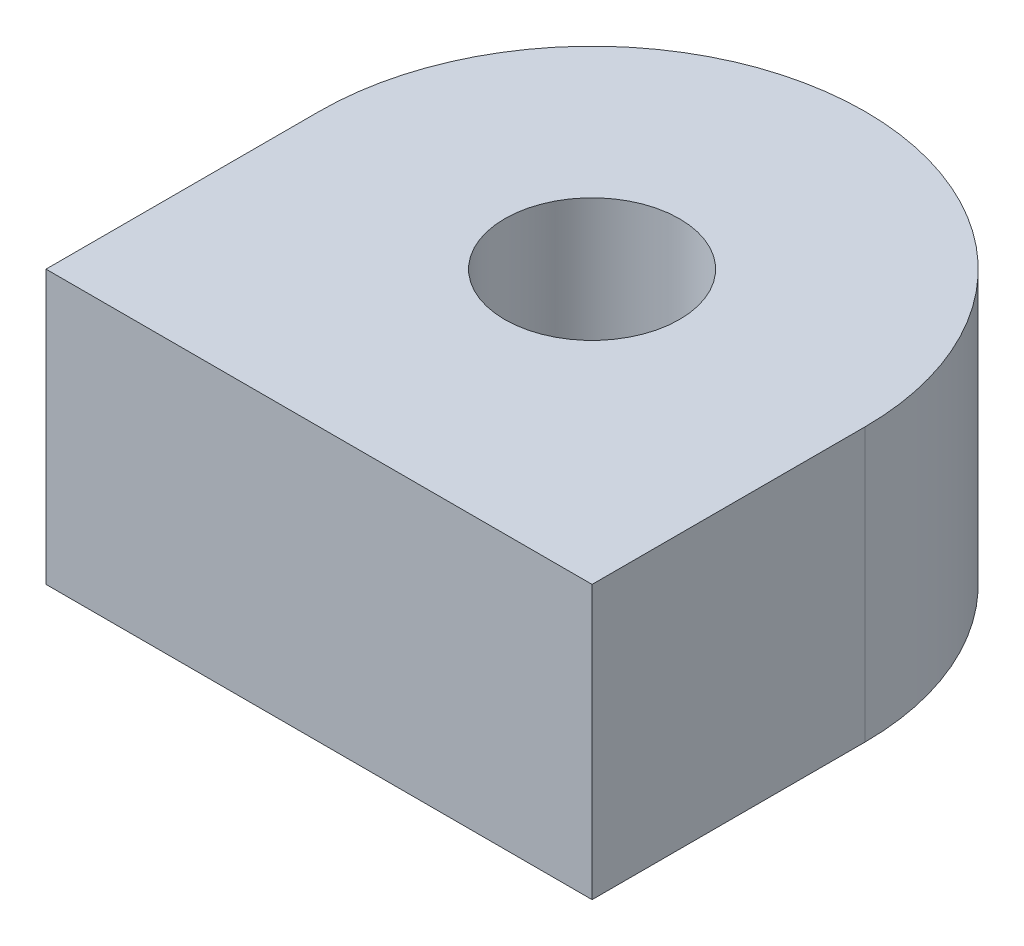
ISO-10303-21;
HEADER;
FILE_DESCRIPTION(('STEP AP214'),'2;1');
FILE_NAME('part.step','',(''),(''),'','','');
FILE_SCHEMA(('AUTOMOTIVE_DESIGN { 1 0 10303 214 1 1 1 1 }'));
ENDSEC;
DATA;
#1=APPLICATION_CONTEXT('core data for automotive mechanical design processes');
#2=APPLICATION_PROTOCOL_DEFINITION('international standard','automotive_design',2000,#1);
#3=PRODUCT_CONTEXT('',#1,'mechanical');
#4=PRODUCT('Part','Part','',(#3));
#5=PRODUCT_RELATED_PRODUCT_CATEGORY('part','',(#4));
#6=PRODUCT_DEFINITION_FORMATION('','',#4);
#7=PRODUCT_DEFINITION_CONTEXT('part definition',#1,'design');
#8=PRODUCT_DEFINITION('design','',#6,#7);
#9=PRODUCT_DEFINITION_SHAPE('','',#8);
#10=(LENGTH_UNIT() NAMED_UNIT(*) SI_UNIT(.MILLI.,.METRE.));
#11=(NAMED_UNIT(*) PLANE_ANGLE_UNIT() SI_UNIT($,.RADIAN.));
#12=(NAMED_UNIT(*) SI_UNIT($,.STERADIAN.) SOLID_ANGLE_UNIT());
#13=UNCERTAINTY_MEASURE_WITH_UNIT(LENGTH_MEASURE(1.E-05),#10,'distance_accuracy_value','');
#14=(GEOMETRIC_REPRESENTATION_CONTEXT(3) GLOBAL_UNCERTAINTY_ASSIGNED_CONTEXT((#13)) GLOBAL_UNIT_ASSIGNED_CONTEXT((#10,
#11,#12)) REPRESENTATION_CONTEXT('',''));
#15=CARTESIAN_POINT('',(0.,0.,0.));
#16=DIRECTION('',(0.,0.,1.));
#17=DIRECTION('',(1.,0.,0.));
#18=AXIS2_PLACEMENT_3D('',#15,#16,#17);
#19=CARTESIAN_POINT('',(10.,-10.,0.));
#20=DIRECTION('',(0.,1.,0.));
#21=DIRECTION('',(0.,0.,1.));
#22=AXIS2_PLACEMENT_3D('',#19,#20,#21);
#23=CYLINDRICAL_SURFACE('',#22,10.);
#24=CARTESIAN_POINT('',(10.,0.,0.));
#25=DIRECTION('',(0.,1.,0.));
#26=DIRECTION('',(0.,0.,-1.));
#27=AXIS2_PLACEMENT_3D('',#24,#25,#26);
#28=CIRCLE('',#27,10.);
#29=CARTESIAN_POINT('',(20.,0.,0.));
#30=VERTEX_POINT('',#29);
#31=CARTESIAN_POINT('',(0.,0.,0.));
#32=VERTEX_POINT('',#31);
#33=EDGE_CURVE('E116',#30,#32,#28,.T.);
#34=ORIENTED_EDGE('',*,*,#33,.F.);
#35=DIRECTION('',(0.,1.,0.));
#36=VECTOR('',#35,1.);
#37=CARTESIAN_POINT('',(20.,-10.,0.));
#38=LINE('',#37,#36);
#39=CARTESIAN_POINT('',(20.,-10.,0.));
#40=VERTEX_POINT('',#39);
#41=EDGE_CURVE('E11',#40,#30,#38,.T.);
#42=ORIENTED_EDGE('',*,*,#41,.F.);
#43=CARTESIAN_POINT('',(10.,-10.,0.));
#44=DIRECTION('',(0.,1.,0.));
#45=DIRECTION('',(0.,0.,-1.));
#46=AXIS2_PLACEMENT_3D('',#43,#44,#45);
#47=CIRCLE('',#46,10.);
#48=CARTESIAN_POINT('',(0.,-10.,0.));
#49=VERTEX_POINT('',#48);
#50=EDGE_CURVE('E107',#40,#49,#47,.T.);
#51=ORIENTED_EDGE('',*,*,#50,.T.);
#52=DIRECTION('',(0.,1.,0.));
#53=VECTOR('',#52,1.);
#54=CARTESIAN_POINT('',(0.,-10.,0.));
#55=LINE('',#54,#53);
#56=EDGE_CURVE('E48',#49,#32,#55,.T.);
#57=ORIENTED_EDGE('',*,*,#56,.T.);
#58=EDGE_LOOP('',(#34,#42,#51,#57));
#59=FACE_BOUND('',#58,.T.);
#60=ADVANCED_FACE('F45',(#59),#23,.T.);
#61=CARTESIAN_POINT('',(20.,-10.,10.));
#62=DIRECTION('',(1.,0.,0.));
#63=DIRECTION('',(0.,0.,-1.));
#64=AXIS2_PLACEMENT_3D('',#61,#62,#63);
#65=PLANE('',#64);
#66=DIRECTION('',(0.,0.,-1.));
#67=VECTOR('',#66,1.);
#68=CARTESIAN_POINT('',(20.,0.,10.));
#69=LINE('',#68,#67);
#70=CARTESIAN_POINT('',(20.,0.,10.));
#71=VERTEX_POINT('',#70);
#72=EDGE_CURVE('E110',#71,#30,#69,.T.);
#73=ORIENTED_EDGE('',*,*,#72,.F.);
#74=DIRECTION('',(0.,1.,0.));
#75=VECTOR('',#74,1.);
#76=CARTESIAN_POINT('',(20.,-10.,10.));
#77=LINE('',#76,#75);
#78=CARTESIAN_POINT('',(20.,-10.,10.));
#79=VERTEX_POINT('',#78);
#80=EDGE_CURVE('E55',#79,#71,#77,.T.);
#81=ORIENTED_EDGE('',*,*,#80,.F.);
#82=DIRECTION('',(0.,0.,-1.));
#83=VECTOR('',#82,1.);
#84=CARTESIAN_POINT('',(20.,-10.,10.));
#85=LINE('',#84,#83);
#86=EDGE_CURVE('E102',#79,#40,#85,.T.);
#87=ORIENTED_EDGE('',*,*,#86,.T.);
#88=ORIENTED_EDGE('',*,*,#41,.T.);
#89=EDGE_LOOP('',(#73,#81,#87,#88));
#90=FACE_BOUND('',#89,.T.);
#91=ADVANCED_FACE('F133',(#90),#65,.T.);
#92=CARTESIAN_POINT('',(0.,-10.,10.));
#93=DIRECTION('',(0.,0.,1.));
#94=DIRECTION('',(1.,0.,0.));
#95=AXIS2_PLACEMENT_3D('',#92,#93,#94);
#96=PLANE('',#95);
#97=DIRECTION('',(1.,0.,0.));
#98=VECTOR('',#97,1.);
#99=CARTESIAN_POINT('',(0.,0.,10.));
#100=LINE('',#99,#98);
#101=CARTESIAN_POINT('',(0.,0.,10.));
#102=VERTEX_POINT('',#101);
#103=EDGE_CURVE('E96',#102,#71,#100,.T.);
#104=ORIENTED_EDGE('',*,*,#103,.F.);
#105=DIRECTION('',(0.,1.,0.));
#106=VECTOR('',#105,1.);
#107=CARTESIAN_POINT('',(0.,-10.,10.));
#108=LINE('',#107,#106);
#109=CARTESIAN_POINT('',(0.,-10.,10.));
#110=VERTEX_POINT('',#109);
#111=EDGE_CURVE('E91',#110,#102,#108,.T.);
#112=ORIENTED_EDGE('',*,*,#111,.F.);
#113=DIRECTION('',(1.,0.,0.));
#114=VECTOR('',#113,1.);
#115=CARTESIAN_POINT('',(0.,-10.,10.));
#116=LINE('',#115,#114);
#117=EDGE_CURVE('E94',#110,#79,#116,.T.);
#118=ORIENTED_EDGE('',*,*,#117,.T.);
#119=ORIENTED_EDGE('',*,*,#80,.T.);
#120=EDGE_LOOP('',(#104,#112,#118,#119));
#121=FACE_BOUND('',#120,.T.);
#122=ADVANCED_FACE('F93',(#121),#96,.T.);
#123=CARTESIAN_POINT('',(0.,-10.,0.));
#124=DIRECTION('',(-1.,0.,0.));
#125=DIRECTION('',(0.,0.,1.));
#126=AXIS2_PLACEMENT_3D('',#123,#124,#125);
#127=PLANE('',#126);
#128=DIRECTION('',(0.,0.,1.));
#129=VECTOR('',#128,1.);
#130=CARTESIAN_POINT('',(0.,0.,0.));
#131=LINE('',#130,#129);
#132=EDGE_CURVE('E120',#32,#102,#131,.T.);
#133=ORIENTED_EDGE('',*,*,#132,.F.);
#134=ORIENTED_EDGE('',*,*,#56,.F.);
#135=DIRECTION('',(0.,0.,1.));
#136=VECTOR('',#135,1.);
#137=CARTESIAN_POINT('',(0.,-10.,0.));
#138=LINE('',#137,#136);
#139=EDGE_CURVE('E101',#49,#110,#138,.T.);
#140=ORIENTED_EDGE('',*,*,#139,.T.);
#141=ORIENTED_EDGE('',*,*,#111,.T.);
#142=EDGE_LOOP('',(#133,#134,#140,#141));
#143=FACE_BOUND('',#142,.T.);
#144=ADVANCED_FACE('F105',(#143),#127,.T.);
#145=CARTESIAN_POINT('',(10.,-10.,0.));
#146=DIRECTION('',(0.,-1.,0.));
#147=DIRECTION('',(0.,0.,-1.));
#148=AXIS2_PLACEMENT_3D('',#145,#146,#147);
#149=PLANE('',#148);
#150=CARTESIAN_POINT('',(10.,-10.,0.));
#151=DIRECTION('',(0.,1.,0.));
#152=DIRECTION('',(0.,0.,1.));
#153=AXIS2_PLACEMENT_3D('',#150,#151,#152);
#154=CIRCLE('',#153,3.2);
#155=CARTESIAN_POINT('',(10.,-10.,3.2));
#156=VERTEX_POINT('',#155);
#157=EDGE_CURVE('E121',#156,#156,#154,.T.);
#158=ORIENTED_EDGE('',*,*,#157,.T.);
#159=EDGE_LOOP('',(#158));
#160=FACE_BOUND('',#159,.T.);
#161=ORIENTED_EDGE('',*,*,#50,.F.);
#162=ORIENTED_EDGE('',*,*,#86,.F.);
#163=ORIENTED_EDGE('',*,*,#117,.F.);
#164=ORIENTED_EDGE('',*,*,#139,.F.);
#165=EDGE_LOOP('',(#161,#162,#163,#164));
#166=FACE_BOUND('',#165,.T.);
#167=ADVANCED_FACE('F100',(#160,#166),#149,.T.);
#168=CARTESIAN_POINT('',(10.,0.,0.));
#169=DIRECTION('',(0.,-1.,0.));
#170=DIRECTION('',(0.,0.,-1.));
#171=AXIS2_PLACEMENT_3D('',#168,#169,#170);
#172=PLANE('',#171);
#173=CARTESIAN_POINT('',(10.,0.,0.));
#174=DIRECTION('',(0.,1.,0.));
#175=DIRECTION('',(0.,0.,1.));
#176=AXIS2_PLACEMENT_3D('',#173,#174,#175);
#177=CIRCLE('',#176,3.2);
#178=CARTESIAN_POINT('',(10.,0.,3.2));
#179=VERTEX_POINT('',#178);
#180=EDGE_CURVE('E163',#179,#179,#177,.T.);
#181=ORIENTED_EDGE('',*,*,#180,.F.);
#182=EDGE_LOOP('',(#181));
#183=FACE_BOUND('',#182,.T.);
#184=ORIENTED_EDGE('',*,*,#33,.T.);
#185=ORIENTED_EDGE('',*,*,#132,.T.);
#186=ORIENTED_EDGE('',*,*,#103,.T.);
#187=ORIENTED_EDGE('',*,*,#72,.T.);
#188=EDGE_LOOP('',(#184,#185,#186,#187));
#189=FACE_BOUND('',#188,.T.);
#190=ADVANCED_FACE('F132',(#183,#189),#172,.F.);
#191=CARTESIAN_POINT('',(10.,-10.,0.));
#192=DIRECTION('',(0.,1.,0.));
#193=DIRECTION('',(0.,0.,1.));
#194=AXIS2_PLACEMENT_3D('',#191,#192,#193);
#195=CYLINDRICAL_SURFACE('',#194,3.2);
#196=ORIENTED_EDGE('',*,*,#157,.F.);
#197=EDGE_LOOP('',(#196));
#198=FACE_BOUND('',#197,.T.);
#199=ORIENTED_EDGE('',*,*,#180,.T.);
#200=EDGE_LOOP('',(#199));
#201=FACE_BOUND('',#200,.T.);
#202=ADVANCED_FACE('F151',(#198,#201),#195,.F.);
#203=CLOSED_SHELL('',(#60,#91,#122,#144,#167,#190,#202));
#204=MANIFOLD_SOLID_BREP('B2',#203);
#205=ADVANCED_BREP_SHAPE_REPRESENTATION('',(#18,#204),#14);
#206=SHAPE_DEFINITION_REPRESENTATION(#9,#205);
ENDSEC;
END-ISO-10303-21;
